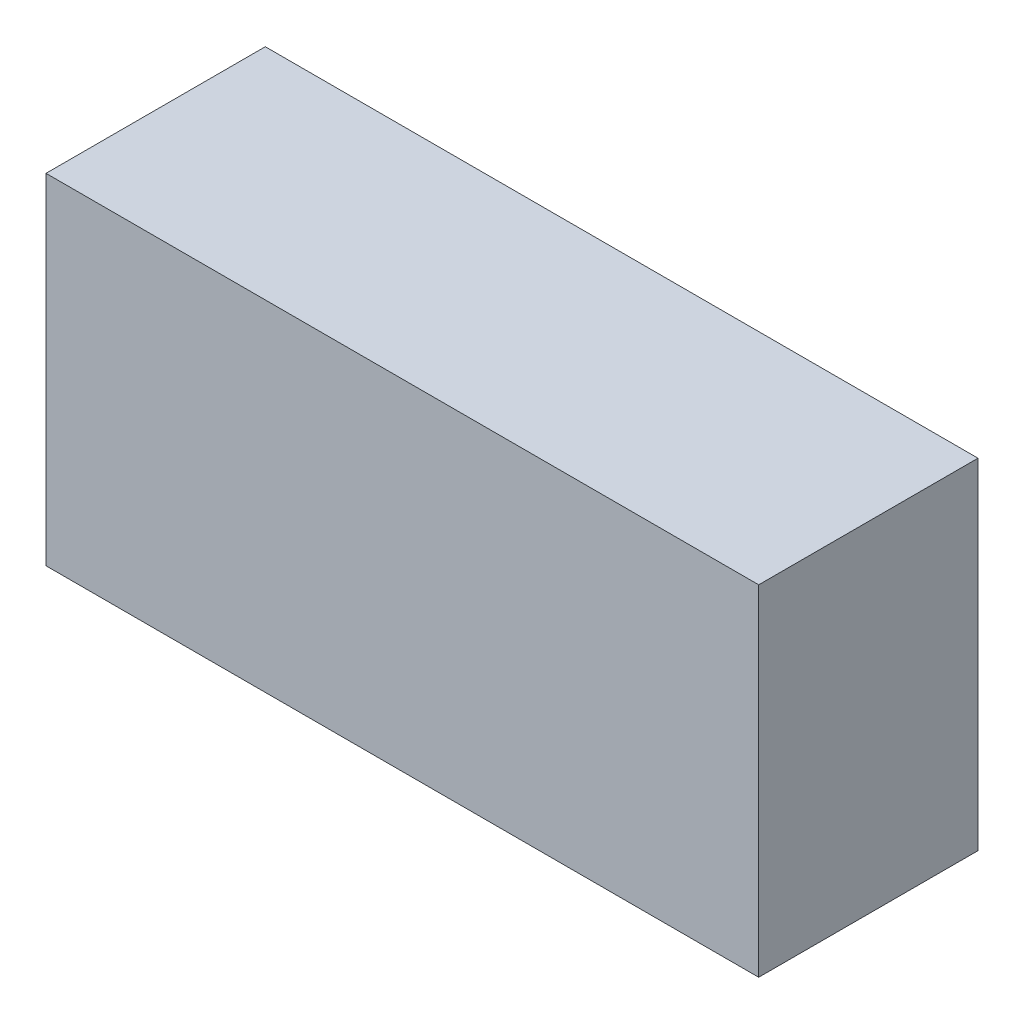
ISO-10303-21;
HEADER;
FILE_DESCRIPTION(('STEP AP214'),'2;1');
FILE_NAME('part.step','',(''),(''),'','','');
FILE_SCHEMA(('AUTOMOTIVE_DESIGN { 1 0 10303 214 1 1 1 1 }'));
ENDSEC;
DATA;
#1=APPLICATION_CONTEXT('core data for automotive mechanical design processes');
#2=APPLICATION_PROTOCOL_DEFINITION('international standard','automotive_design',2000,#1);
#3=PRODUCT_CONTEXT('',#1,'mechanical');
#4=PRODUCT('Part','Part','',(#3));
#5=PRODUCT_RELATED_PRODUCT_CATEGORY('part','',(#4));
#6=PRODUCT_DEFINITION_FORMATION('','',#4);
#7=PRODUCT_DEFINITION_CONTEXT('part definition',#1,'design');
#8=PRODUCT_DEFINITION('design','',#6,#7);
#9=PRODUCT_DEFINITION_SHAPE('','',#8);
#10=(LENGTH_UNIT() NAMED_UNIT(*) SI_UNIT(.MILLI.,.METRE.));
#11=(NAMED_UNIT(*) PLANE_ANGLE_UNIT() SI_UNIT($,.RADIAN.));
#12=(NAMED_UNIT(*) SI_UNIT($,.STERADIAN.) SOLID_ANGLE_UNIT());
#13=UNCERTAINTY_MEASURE_WITH_UNIT(LENGTH_MEASURE(1.E-05),#10,'distance_accuracy_value','');
#14=(GEOMETRIC_REPRESENTATION_CONTEXT(3) GLOBAL_UNCERTAINTY_ASSIGNED_CONTEXT((#13)) GLOBAL_UNIT_ASSIGNED_CONTEXT((#10,
#11,#12)) REPRESENTATION_CONTEXT('',''));
#15=CARTESIAN_POINT('',(0.,0.,0.));
#16=DIRECTION('',(0.,0.,1.));
#17=DIRECTION('',(1.,0.,0.));
#18=AXIS2_PLACEMENT_3D('',#15,#16,#17);
#19=CARTESIAN_POINT('',(9.75,9.3,-3.));
#20=DIRECTION('',(-1.,0.,0.));
#21=DIRECTION('',(0.,0.,1.));
#22=AXIS2_PLACEMENT_3D('',#19,#20,#21);
#23=PLANE('',#22);
#24=DIRECTION('',(0.,0.,-1.));
#25=VECTOR('',#24,1.);
#26=CARTESIAN_POINT('',(9.75,0.,-3.));
#27=LINE('',#26,#25);
#28=CARTESIAN_POINT('',(9.75,0.,3.));
#29=VERTEX_POINT('',#28);
#30=CARTESIAN_POINT('',(9.75,0.,-3.));
#31=VERTEX_POINT('',#30);
#32=EDGE_CURVE('E337',#29,#31,#27,.T.);
#33=ORIENTED_EDGE('',*,*,#32,.T.);
#34=DIRECTION('',(0.,-1.,0.));
#35=VECTOR('',#34,1.);
#36=CARTESIAN_POINT('',(9.75,9.3,-3.));
#37=LINE('',#36,#35);
#38=CARTESIAN_POINT('',(9.75,9.3,-3.));
#39=VERTEX_POINT('',#38);
#40=EDGE_CURVE('E11',#39,#31,#37,.T.);
#41=ORIENTED_EDGE('',*,*,#40,.F.);
#42=DIRECTION('',(0.,0.,-1.));
#43=VECTOR('',#42,1.);
#44=CARTESIAN_POINT('',(9.75,9.3,-3.));
#45=LINE('',#44,#43);
#46=CARTESIAN_POINT('',(9.75,9.3,3.));
#47=VERTEX_POINT('',#46);
#48=EDGE_CURVE('E348',#47,#39,#45,.T.);
#49=ORIENTED_EDGE('',*,*,#48,.F.);
#50=DIRECTION('',(0.,-1.,0.));
#51=VECTOR('',#50,1.);
#52=CARTESIAN_POINT('',(9.75,9.3,3.));
#53=LINE('',#52,#51);
#54=EDGE_CURVE('E362',#47,#29,#53,.T.);
#55=ORIENTED_EDGE('',*,*,#54,.T.);
#56=EDGE_LOOP('',(#33,#41,#49,#55));
#57=FACE_BOUND('',#56,.T.);
#58=ADVANCED_FACE('F39',(#57),#23,.F.);
#59=CARTESIAN_POINT('',(-9.75,9.3,-3.));
#60=DIRECTION('',(0.,0.,1.));
#61=DIRECTION('',(1.,0.,0.));
#62=AXIS2_PLACEMENT_3D('',#59,#60,#61);
#63=PLANE('',#62);
#64=DIRECTION('',(-1.,0.,0.));
#65=VECTOR('',#64,1.);
#66=CARTESIAN_POINT('',(-9.75,0.,-3.));
#67=LINE('',#66,#65);
#68=CARTESIAN_POINT('',(-9.75,0.,-3.));
#69=VERTEX_POINT('',#68);
#70=EDGE_CURVE('E366',#31,#69,#67,.T.);
#71=ORIENTED_EDGE('',*,*,#70,.T.);
#72=DIRECTION('',(0.,-1.,0.));
#73=VECTOR('',#72,1.);
#74=CARTESIAN_POINT('',(-9.75,9.3,-3.));
#75=LINE('',#74,#73);
#76=CARTESIAN_POINT('',(-9.75,9.3,-3.));
#77=VERTEX_POINT('',#76);
#78=EDGE_CURVE('E47',#77,#69,#75,.T.);
#79=ORIENTED_EDGE('',*,*,#78,.F.);
#80=DIRECTION('',(-1.,0.,0.));
#81=VECTOR('',#80,1.);
#82=CARTESIAN_POINT('',(-9.75,9.3,-3.));
#83=LINE('',#82,#81);
#84=EDGE_CURVE('E352',#39,#77,#83,.T.);
#85=ORIENTED_EDGE('',*,*,#84,.F.);
#86=ORIENTED_EDGE('',*,*,#40,.T.);
#87=EDGE_LOOP('',(#71,#79,#85,#86));
#88=FACE_BOUND('',#87,.T.);
#89=ADVANCED_FACE('F401',(#88),#63,.F.);
#90=CARTESIAN_POINT('',(-9.75,9.3,-3.));
#91=DIRECTION('',(1.,0.,0.));
#92=DIRECTION('',(0.,0.,-1.));
#93=AXIS2_PLACEMENT_3D('',#90,#91,#92);
#94=PLANE('',#93);
#95=DIRECTION('',(0.,0.,1.));
#96=VECTOR('',#95,1.);
#97=CARTESIAN_POINT('',(-9.75,0.,-3.));
#98=LINE('',#97,#96);
#99=CARTESIAN_POINT('',(-9.75,0.,3.));
#100=VERTEX_POINT('',#99);
#101=EDGE_CURVE('E369',#69,#100,#98,.T.);
#102=ORIENTED_EDGE('',*,*,#101,.T.);
#103=DIRECTION('',(0.,-1.,0.));
#104=VECTOR('',#103,1.);
#105=CARTESIAN_POINT('',(-9.75,9.3,3.));
#106=LINE('',#105,#104);
#107=CARTESIAN_POINT('',(-9.75,9.3,3.));
#108=VERTEX_POINT('',#107);
#109=EDGE_CURVE('E377',#108,#100,#106,.T.);
#110=ORIENTED_EDGE('',*,*,#109,.F.);
#111=DIRECTION('',(0.,0.,1.));
#112=VECTOR('',#111,1.);
#113=CARTESIAN_POINT('',(-9.75,9.3,-3.));
#114=LINE('',#113,#112);
#115=EDGE_CURVE('E356',#77,#108,#114,.T.);
#116=ORIENTED_EDGE('',*,*,#115,.F.);
#117=ORIENTED_EDGE('',*,*,#78,.T.);
#118=EDGE_LOOP('',(#102,#110,#116,#117));
#119=FACE_BOUND('',#118,.T.);
#120=ADVANCED_FACE('F386',(#119),#94,.F.);
#121=CARTESIAN_POINT('',(-9.75,9.3,3.));
#122=DIRECTION('',(0.,0.,-1.));
#123=DIRECTION('',(-1.,0.,0.));
#124=AXIS2_PLACEMENT_3D('',#121,#122,#123);
#125=PLANE('',#124);
#126=DIRECTION('',(1.,0.,0.));
#127=VECTOR('',#126,1.);
#128=CARTESIAN_POINT('',(-9.75,0.,3.));
#129=LINE('',#128,#127);
#130=EDGE_CURVE('E353',#100,#29,#129,.T.);
#131=ORIENTED_EDGE('',*,*,#130,.T.);
#132=ORIENTED_EDGE('',*,*,#54,.F.);
#133=DIRECTION('',(1.,0.,0.));
#134=VECTOR('',#133,1.);
#135=CARTESIAN_POINT('',(-9.75,9.3,3.));
#136=LINE('',#135,#134);
#137=EDGE_CURVE('E359',#108,#47,#136,.T.);
#138=ORIENTED_EDGE('',*,*,#137,.F.);
#139=ORIENTED_EDGE('',*,*,#109,.T.);
#140=EDGE_LOOP('',(#131,#132,#138,#139));
#141=FACE_BOUND('',#140,.T.);
#142=ADVANCED_FACE('F394',(#141),#125,.F.);
#143=CARTESIAN_POINT('',(0.,9.3,0.));
#144=DIRECTION('',(0.,1.,0.));
#145=DIRECTION('',(0.,0.,1.));
#146=AXIS2_PLACEMENT_3D('',#143,#144,#145);
#147=PLANE('',#146);
#148=ORIENTED_EDGE('',*,*,#48,.T.);
#149=ORIENTED_EDGE('',*,*,#84,.T.);
#150=ORIENTED_EDGE('',*,*,#115,.T.);
#151=ORIENTED_EDGE('',*,*,#137,.T.);
#152=EDGE_LOOP('',(#148,#149,#150,#151));
#153=FACE_BOUND('',#152,.T.);
#154=ADVANCED_FACE('F400',(#153),#147,.T.);
#155=CARTESIAN_POINT('',(0.,0.,0.));
#156=DIRECTION('',(0.,1.,0.));
#157=DIRECTION('',(0.,0.,1.));
#158=AXIS2_PLACEMENT_3D('',#155,#156,#157);
#159=PLANE('',#158);
#160=DIRECTION('',(0.,0.,-1.));
#161=VECTOR('',#160,1.);
#162=CARTESIAN_POINT('',(4.78,0.,-1.2));
#163=LINE('',#162,#161);
#164=CARTESIAN_POINT('',(4.78,0.,-1.2));
#165=VERTEX_POINT('',#164);
#166=CARTESIAN_POINT('',(4.78,0.,-1.5));
#167=VERTEX_POINT('',#166);
#168=EDGE_CURVE('E184',#165,#167,#163,.T.);
#169=ORIENTED_EDGE('',*,*,#168,.F.);
#170=DIRECTION('',(1.,0.,0.));
#171=VECTOR('',#170,1.);
#172=CARTESIAN_POINT('',(4.78,0.,-1.2));
#173=LINE('',#172,#171);
#174=CARTESIAN_POINT('',(5.38,0.,-1.2));
#175=VERTEX_POINT('',#174);
#176=EDGE_CURVE('E193',#165,#175,#173,.T.);
#177=ORIENTED_EDGE('',*,*,#176,.T.);
#178=DIRECTION('',(0.,0.,-1.));
#179=VECTOR('',#178,1.);
#180=CARTESIAN_POINT('',(5.38,0.,-1.2));
#181=LINE('',#180,#179);
#182=CARTESIAN_POINT('',(5.38,0.,-1.5));
#183=VERTEX_POINT('',#182);
#184=EDGE_CURVE('E201',#175,#183,#181,.T.);
#185=ORIENTED_EDGE('',*,*,#184,.T.);
#186=DIRECTION('',(1.,0.,0.));
#187=VECTOR('',#186,1.);
#188=CARTESIAN_POINT('',(4.78,0.,-1.5));
#189=LINE('',#188,#187);
#190=EDGE_CURVE('E54',#167,#183,#189,.T.);
#191=ORIENTED_EDGE('',*,*,#190,.F.);
#192=EDGE_LOOP('',(#169,#177,#185,#191));
#193=FACE_BOUND('',#192,.T.);
#194=DIRECTION('',(0.,0.,-1.));
#195=VECTOR('',#194,1.);
#196=CARTESIAN_POINT('',(-0.299999999999996,0.,-1.2));
#197=LINE('',#196,#195);
#198=CARTESIAN_POINT('',(-0.299999999999996,0.,-1.2));
#199=VERTEX_POINT('',#198);
#200=CARTESIAN_POINT('',(-0.299999999999996,0.,-1.5));
#201=VERTEX_POINT('',#200);
#202=EDGE_CURVE('E237',#199,#201,#197,.T.);
#203=ORIENTED_EDGE('',*,*,#202,.F.);
#204=DIRECTION('',(1.,0.,0.));
#205=VECTOR('',#204,1.);
#206=CARTESIAN_POINT('',(-0.299999999999996,0.,-1.2));
#207=LINE('',#206,#205);
#208=CARTESIAN_POINT('',(0.300000000000004,0.,-1.2));
#209=VERTEX_POINT('',#208);
#210=EDGE_CURVE('E247',#199,#209,#207,.T.);
#211=ORIENTED_EDGE('',*,*,#210,.T.);
#212=DIRECTION('',(0.,0.,-1.));
#213=VECTOR('',#212,1.);
#214=CARTESIAN_POINT('',(0.300000000000004,0.,-1.2));
#215=LINE('',#214,#213);
#216=CARTESIAN_POINT('',(0.300000000000004,0.,-1.5));
#217=VERTEX_POINT('',#216);
#218=EDGE_CURVE('E243',#209,#217,#215,.T.);
#219=ORIENTED_EDGE('',*,*,#218,.T.);
#220=DIRECTION('',(1.,0.,0.));
#221=VECTOR('',#220,1.);
#222=CARTESIAN_POINT('',(-0.299999999999996,0.,-1.5));
#223=LINE('',#222,#221);
#224=EDGE_CURVE('E62',#201,#217,#223,.T.);
#225=ORIENTED_EDGE('',*,*,#224,.F.);
#226=EDGE_LOOP('',(#203,#211,#219,#225));
#227=FACE_BOUND('',#226,.T.);
#228=DIRECTION('',(0.,0.,-1.));
#229=VECTOR('',#228,1.);
#230=CARTESIAN_POINT('',(-5.38,0.,-1.2));
#231=LINE('',#230,#229);
#232=CARTESIAN_POINT('',(-5.38,0.,-1.2));
#233=VERTEX_POINT('',#232);
#234=CARTESIAN_POINT('',(-5.38,0.,-1.5));
#235=VERTEX_POINT('',#234);
#236=EDGE_CURVE('E278',#233,#235,#231,.T.);
#237=ORIENTED_EDGE('',*,*,#236,.F.);
#238=DIRECTION('',(1.,0.,0.));
#239=VECTOR('',#238,1.);
#240=CARTESIAN_POINT('',(-5.38,0.,-1.2));
#241=LINE('',#240,#239);
#242=CARTESIAN_POINT('',(-4.78,0.,-1.2));
#243=VERTEX_POINT('',#242);
#244=EDGE_CURVE('E289',#233,#243,#241,.T.);
#245=ORIENTED_EDGE('',*,*,#244,.T.);
#246=DIRECTION('',(0.,0.,-1.));
#247=VECTOR('',#246,1.);
#248=CARTESIAN_POINT('',(-4.78,0.,-1.2));
#249=LINE('',#248,#247);
#250=CARTESIAN_POINT('',(-4.78,0.,-1.5));
#251=VERTEX_POINT('',#250);
#252=EDGE_CURVE('E285',#243,#251,#249,.T.);
#253=ORIENTED_EDGE('',*,*,#252,.T.);
#254=DIRECTION('',(1.,0.,0.));
#255=VECTOR('',#254,1.);
#256=CARTESIAN_POINT('',(-5.38,0.,-1.5));
#257=LINE('',#256,#255);
#258=EDGE_CURVE('E281',#235,#251,#257,.T.);
#259=ORIENTED_EDGE('',*,*,#258,.F.);
#260=EDGE_LOOP('',(#237,#245,#253,#259));
#261=FACE_BOUND('',#260,.T.);
#262=DIRECTION('',(0.,0.,-1.));
#263=VECTOR('',#262,1.);
#264=CARTESIAN_POINT('',(-7.92,0.,-1.2));
#265=LINE('',#264,#263);
#266=CARTESIAN_POINT('',(-7.92,0.,-1.2));
#267=VERTEX_POINT('',#266);
#268=CARTESIAN_POINT('',(-7.92,0.,-1.5));
#269=VERTEX_POINT('',#268);
#270=EDGE_CURVE('E311',#267,#269,#265,.T.);
#271=ORIENTED_EDGE('',*,*,#270,.F.);
#272=DIRECTION('',(1.,0.,0.));
#273=VECTOR('',#272,1.);
#274=CARTESIAN_POINT('',(-7.92,0.,-1.2));
#275=LINE('',#274,#273);
#276=CARTESIAN_POINT('',(-7.32,0.,-1.2));
#277=VERTEX_POINT('',#276);
#278=EDGE_CURVE('E293',#267,#277,#275,.T.);
#279=ORIENTED_EDGE('',*,*,#278,.T.);
#280=DIRECTION('',(0.,0.,-1.));
#281=VECTOR('',#280,1.);
#282=CARTESIAN_POINT('',(-7.32,0.,-1.2));
#283=LINE('',#282,#281);
#284=CARTESIAN_POINT('',(-7.31999999999999,0.,-1.5));
#285=VERTEX_POINT('',#284);
#286=EDGE_CURVE('E325',#277,#285,#283,.T.);
#287=ORIENTED_EDGE('',*,*,#286,.T.);
#288=DIRECTION('',(1.,0.,0.));
#289=VECTOR('',#288,1.);
#290=CARTESIAN_POINT('',(-7.92,0.,-1.5));
#291=LINE('',#290,#289);
#292=EDGE_CURVE('E329',#269,#285,#291,.T.);
#293=ORIENTED_EDGE('',*,*,#292,.F.);
#294=EDGE_LOOP('',(#271,#279,#287,#293));
#295=FACE_BOUND('',#294,.T.);
#296=ORIENTED_EDGE('',*,*,#32,.F.);
#297=ORIENTED_EDGE('',*,*,#130,.F.);
#298=ORIENTED_EDGE('',*,*,#101,.F.);
#299=ORIENTED_EDGE('',*,*,#70,.F.);
#300=EDGE_LOOP('',(#296,#297,#298,#299));
#301=FACE_BOUND('',#300,.T.);
#302=ADVANCED_FACE('F203',(#193,#227,#261,#295,#301),#159,.F.);
#303=CARTESIAN_POINT('',(-7.92,-3.,-1.2));
#304=DIRECTION('',(0.,0.,1.));
#305=DIRECTION('',(1.,0.,0.));
#306=AXIS2_PLACEMENT_3D('',#303,#304,#305);
#307=PLANE('',#306);
#308=ORIENTED_EDGE('',*,*,#278,.F.);
#309=DIRECTION('',(0.,1.,0.));
#310=VECTOR('',#309,1.);
#311=CARTESIAN_POINT('',(-7.92,-3.,-1.2));
#312=LINE('',#311,#310);
#313=CARTESIAN_POINT('',(-7.92,-3.,-1.2));
#314=VERTEX_POINT('',#313);
#315=EDGE_CURVE('E334',#314,#267,#312,.T.);
#316=ORIENTED_EDGE('',*,*,#315,.F.);
#317=DIRECTION('',(1.,0.,0.));
#318=VECTOR('',#317,1.);
#319=CARTESIAN_POINT('',(-7.92,-3.,-1.2));
#320=LINE('',#319,#318);
#321=CARTESIAN_POINT('',(-7.32,-3.,-1.2));
#322=VERTEX_POINT('',#321);
#323=EDGE_CURVE('E306',#314,#322,#320,.T.);
#324=ORIENTED_EDGE('',*,*,#323,.T.);
#325=DIRECTION('',(0.,1.,0.));
#326=VECTOR('',#325,1.);
#327=CARTESIAN_POINT('',(-7.32,-3.,-1.2));
#328=LINE('',#327,#326);
#329=EDGE_CURVE('E321',#322,#277,#328,.T.);
#330=ORIENTED_EDGE('',*,*,#329,.T.);
#331=EDGE_LOOP('',(#308,#316,#324,#330));
#332=FACE_BOUND('',#331,.T.);
#333=ADVANCED_FACE('F413',(#332),#307,.T.);
#334=CARTESIAN_POINT('',(-7.92,-3.,-1.2));
#335=DIRECTION('',(1.,0.,0.));
#336=DIRECTION('',(0.,0.,-1.));
#337=AXIS2_PLACEMENT_3D('',#334,#335,#336);
#338=PLANE('',#337);
#339=ORIENTED_EDGE('',*,*,#270,.T.);
#340=DIRECTION('',(0.,1.,0.));
#341=VECTOR('',#340,1.);
#342=CARTESIAN_POINT('',(-7.92,-3.,-1.5));
#343=LINE('',#342,#341);
#344=CARTESIAN_POINT('',(-7.92,-3.,-1.5));
#345=VERTEX_POINT('',#344);
#346=EDGE_CURVE('E338',#345,#269,#343,.T.);
#347=ORIENTED_EDGE('',*,*,#346,.F.);
#348=DIRECTION('',(0.,0.,-1.));
#349=VECTOR('',#348,1.);
#350=CARTESIAN_POINT('',(-7.92,-3.,-1.2));
#351=LINE('',#350,#349);
#352=EDGE_CURVE('E318',#314,#345,#351,.T.);
#353=ORIENTED_EDGE('',*,*,#352,.F.);
#354=ORIENTED_EDGE('',*,*,#315,.T.);
#355=EDGE_LOOP('',(#339,#347,#353,#354));
#356=FACE_BOUND('',#355,.T.);
#357=ADVANCED_FACE('F418',(#356),#338,.F.);
#358=CARTESIAN_POINT('',(-7.92,-3.,-1.5));
#359=DIRECTION('',(0.,0.,1.));
#360=DIRECTION('',(1.,0.,0.));
#361=AXIS2_PLACEMENT_3D('',#358,#359,#360);
#362=PLANE('',#361);
#363=ORIENTED_EDGE('',*,*,#292,.T.);
#364=DIRECTION('',(0.,1.,0.));
#365=VECTOR('',#364,1.);
#366=CARTESIAN_POINT('',(-7.31999999999999,-3.,-1.5));
#367=LINE('',#366,#365);
#368=CARTESIAN_POINT('',(-7.31999999999999,-3.,-1.5));
#369=VERTEX_POINT('',#368);
#370=EDGE_CURVE('E342',#369,#285,#367,.T.);
#371=ORIENTED_EDGE('',*,*,#370,.F.);
#372=DIRECTION('',(1.,0.,0.));
#373=VECTOR('',#372,1.);
#374=CARTESIAN_POINT('',(-7.92,-3.,-1.5));
#375=LINE('',#374,#373);
#376=EDGE_CURVE('E315',#345,#369,#375,.T.);
#377=ORIENTED_EDGE('',*,*,#376,.F.);
#378=ORIENTED_EDGE('',*,*,#346,.T.);
#379=EDGE_LOOP('',(#363,#371,#377,#378));
#380=FACE_BOUND('',#379,.T.);
#381=ADVANCED_FACE('F424',(#380),#362,.F.);
#382=CARTESIAN_POINT('',(-7.32,-3.,-1.2));
#383=DIRECTION('',(1.,0.,0.));
#384=DIRECTION('',(0.,0.,-1.));
#385=AXIS2_PLACEMENT_3D('',#382,#383,#384);
#386=PLANE('',#385);
#387=ORIENTED_EDGE('',*,*,#286,.F.);
#388=ORIENTED_EDGE('',*,*,#329,.F.);
#389=DIRECTION('',(0.,0.,-1.));
#390=VECTOR('',#389,1.);
#391=CARTESIAN_POINT('',(-7.32,-3.,-1.2));
#392=LINE('',#391,#390);
#393=EDGE_CURVE('E310',#322,#369,#392,.T.);
#394=ORIENTED_EDGE('',*,*,#393,.T.);
#395=ORIENTED_EDGE('',*,*,#370,.T.);
#396=EDGE_LOOP('',(#387,#388,#394,#395));
#397=FACE_BOUND('',#396,.T.);
#398=ADVANCED_FACE('F420',(#397),#386,.T.);
#399=CARTESIAN_POINT('',(0.,-3.,0.));
#400=DIRECTION('',(0.,1.,0.));
#401=DIRECTION('',(0.,0.,1.));
#402=AXIS2_PLACEMENT_3D('',#399,#400,#401);
#403=PLANE('',#402);
#404=ORIENTED_EDGE('',*,*,#323,.F.);
#405=ORIENTED_EDGE('',*,*,#352,.T.);
#406=ORIENTED_EDGE('',*,*,#376,.T.);
#407=ORIENTED_EDGE('',*,*,#393,.F.);
#408=EDGE_LOOP('',(#404,#405,#406,#407));
#409=FACE_BOUND('',#408,.T.);
#410=ADVANCED_FACE('F423',(#409),#403,.F.);
#411=CARTESIAN_POINT('',(-5.38,-3.,-1.2));
#412=DIRECTION('',(0.,0.,1.));
#413=DIRECTION('',(1.,0.,0.));
#414=AXIS2_PLACEMENT_3D('',#411,#412,#413);
#415=PLANE('',#414);
#416=ORIENTED_EDGE('',*,*,#244,.F.);
#417=DIRECTION('',(0.,1.,0.));
#418=VECTOR('',#417,1.);
#419=CARTESIAN_POINT('',(-5.38,-3.,-1.2));
#420=LINE('',#419,#418);
#421=CARTESIAN_POINT('',(-5.38,-3.,-1.2));
#422=VERTEX_POINT('',#421);
#423=EDGE_CURVE('E251',#422,#233,#420,.T.);
#424=ORIENTED_EDGE('',*,*,#423,.F.);
#425=DIRECTION('',(1.,0.,0.));
#426=VECTOR('',#425,1.);
#427=CARTESIAN_POINT('',(-5.38,-3.,-1.2));
#428=LINE('',#427,#426);
#429=CARTESIAN_POINT('',(-4.78,-3.,-1.2));
#430=VERTEX_POINT('',#429);
#431=EDGE_CURVE('E282',#422,#430,#428,.T.);
#432=ORIENTED_EDGE('',*,*,#431,.T.);
#433=DIRECTION('',(0.,1.,0.));
#434=VECTOR('',#433,1.);
#435=CARTESIAN_POINT('',(-4.78,-3.,-1.2));
#436=LINE('',#435,#434);
#437=EDGE_CURVE('E264',#430,#243,#436,.T.);
#438=ORIENTED_EDGE('',*,*,#437,.T.);
#439=EDGE_LOOP('',(#416,#424,#432,#438));
#440=FACE_BOUND('',#439,.T.);
#441=ADVANCED_FACE('F434',(#440),#415,.T.);
#442=CARTESIAN_POINT('',(-5.38,-3.,-1.2));
#443=DIRECTION('',(1.,0.,0.));
#444=DIRECTION('',(0.,0.,-1.));
#445=AXIS2_PLACEMENT_3D('',#442,#443,#444);
#446=PLANE('',#445);
#447=ORIENTED_EDGE('',*,*,#236,.T.);
#448=DIRECTION('',(0.,1.,0.));
#449=VECTOR('',#448,1.);
#450=CARTESIAN_POINT('',(-5.38,-3.,-1.5));
#451=LINE('',#450,#449);
#452=CARTESIAN_POINT('',(-5.38,-3.,-1.5));
#453=VERTEX_POINT('',#452);
#454=EDGE_CURVE('E272',#453,#235,#451,.T.);
#455=ORIENTED_EDGE('',*,*,#454,.F.);
#456=DIRECTION('',(0.,0.,-1.));
#457=VECTOR('',#456,1.);
#458=CARTESIAN_POINT('',(-5.38,-3.,-1.2));
#459=LINE('',#458,#457);
#460=EDGE_CURVE('E267',#422,#453,#459,.T.);
#461=ORIENTED_EDGE('',*,*,#460,.F.);
#462=ORIENTED_EDGE('',*,*,#423,.T.);
#463=EDGE_LOOP('',(#447,#455,#461,#462));
#464=FACE_BOUND('',#463,.T.);
#465=ADVANCED_FACE('F442',(#464),#446,.F.);
#466=CARTESIAN_POINT('',(-5.38,-3.,-1.5));
#467=DIRECTION('',(0.,0.,1.));
#468=DIRECTION('',(1.,0.,0.));
#469=AXIS2_PLACEMENT_3D('',#466,#467,#468);
#470=PLANE('',#469);
#471=ORIENTED_EDGE('',*,*,#258,.T.);
#472=DIRECTION('',(0.,1.,0.));
#473=VECTOR('',#472,1.);
#474=CARTESIAN_POINT('',(-4.78,-3.,-1.5));
#475=LINE('',#474,#473);
#476=CARTESIAN_POINT('',(-4.78,-3.,-1.5));
#477=VERTEX_POINT('',#476);
#478=EDGE_CURVE('E268',#477,#251,#475,.T.);
#479=ORIENTED_EDGE('',*,*,#478,.F.);
#480=DIRECTION('',(1.,0.,0.));
#481=VECTOR('',#480,1.);
#482=CARTESIAN_POINT('',(-5.38,-3.,-1.5));
#483=LINE('',#482,#481);
#484=EDGE_CURVE('E296',#453,#477,#483,.T.);
#485=ORIENTED_EDGE('',*,*,#484,.F.);
#486=ORIENTED_EDGE('',*,*,#454,.T.);
#487=EDGE_LOOP('',(#471,#479,#485,#486));
#488=FACE_BOUND('',#487,.T.);
#489=ADVANCED_FACE('F445',(#488),#470,.F.);
#490=CARTESIAN_POINT('',(-4.78,-3.,-1.2));
#491=DIRECTION('',(1.,0.,0.));
#492=DIRECTION('',(0.,0.,-1.));
#493=AXIS2_PLACEMENT_3D('',#490,#491,#492);
#494=PLANE('',#493);
#495=ORIENTED_EDGE('',*,*,#252,.F.);
#496=ORIENTED_EDGE('',*,*,#437,.F.);
#497=DIRECTION('',(0.,0.,-1.));
#498=VECTOR('',#497,1.);
#499=CARTESIAN_POINT('',(-4.78,-3.,-1.2));
#500=LINE('',#499,#498);
#501=EDGE_CURVE('E299',#430,#477,#500,.T.);
#502=ORIENTED_EDGE('',*,*,#501,.T.);
#503=ORIENTED_EDGE('',*,*,#478,.T.);
#504=EDGE_LOOP('',(#495,#496,#502,#503));
#505=FACE_BOUND('',#504,.T.);
#506=ADVANCED_FACE('F440',(#505),#494,.T.);
#507=CARTESIAN_POINT('',(0.,-3.,0.));
#508=DIRECTION('',(0.,1.,0.));
#509=DIRECTION('',(0.,0.,1.));
#510=AXIS2_PLACEMENT_3D('',#507,#508,#509);
#511=PLANE('',#510);
#512=ORIENTED_EDGE('',*,*,#431,.F.);
#513=ORIENTED_EDGE('',*,*,#460,.T.);
#514=ORIENTED_EDGE('',*,*,#484,.T.);
#515=ORIENTED_EDGE('',*,*,#501,.F.);
#516=EDGE_LOOP('',(#512,#513,#514,#515));
#517=FACE_BOUND('',#516,.T.);
#518=ADVANCED_FACE('F436',(#517),#511,.F.);
#519=CARTESIAN_POINT('',(-0.299999999999996,-3.,-1.2));
#520=DIRECTION('',(0.,0.,1.));
#521=DIRECTION('',(1.,0.,0.));
#522=AXIS2_PLACEMENT_3D('',#519,#520,#521);
#523=PLANE('',#522);
#524=ORIENTED_EDGE('',*,*,#210,.F.);
#525=DIRECTION('',(0.,1.,0.));
#526=VECTOR('',#525,1.);
#527=CARTESIAN_POINT('',(-0.299999999999996,-3.,-1.2));
#528=LINE('',#527,#526);
#529=CARTESIAN_POINT('',(-0.299999999999996,-3.,-1.2));
#530=VERTEX_POINT('',#529);
#531=EDGE_CURVE('E200',#530,#199,#528,.T.);
#532=ORIENTED_EDGE('',*,*,#531,.F.);
#533=DIRECTION('',(1.,0.,0.));
#534=VECTOR('',#533,1.);
#535=CARTESIAN_POINT('',(-0.299999999999996,-3.,-1.2));
#536=LINE('',#535,#534);
#537=CARTESIAN_POINT('',(0.300000000000004,-3.,-1.2));
#538=VERTEX_POINT('',#537);
#539=EDGE_CURVE('E240',#530,#538,#536,.T.);
#540=ORIENTED_EDGE('',*,*,#539,.T.);
#541=DIRECTION('',(0.,1.,0.));
#542=VECTOR('',#541,1.);
#543=CARTESIAN_POINT('',(0.300000000000004,-3.,-1.2));
#544=LINE('',#543,#542);
#545=EDGE_CURVE('E225',#538,#209,#544,.T.);
#546=ORIENTED_EDGE('',*,*,#545,.T.);
#547=EDGE_LOOP('',(#524,#532,#540,#546));
#548=FACE_BOUND('',#547,.T.);
#549=ADVANCED_FACE('F439',(#548),#523,.T.);
#550=CARTESIAN_POINT('',(-0.299999999999996,-3.,-1.2));
#551=DIRECTION('',(1.,0.,0.));
#552=DIRECTION('',(0.,0.,-1.));
#553=AXIS2_PLACEMENT_3D('',#550,#551,#552);
#554=PLANE('',#553);
#555=ORIENTED_EDGE('',*,*,#202,.T.);
#556=DIRECTION('',(0.,1.,0.));
#557=VECTOR('',#556,1.);
#558=CARTESIAN_POINT('',(-0.299999999999996,-3.,-1.5));
#559=LINE('',#558,#557);
#560=CARTESIAN_POINT('',(-0.299999999999996,-3.,-1.5));
#561=VERTEX_POINT('',#560);
#562=EDGE_CURVE('E232',#561,#201,#559,.T.);
#563=ORIENTED_EDGE('',*,*,#562,.F.);
#564=DIRECTION('',(0.,0.,-1.));
#565=VECTOR('',#564,1.);
#566=CARTESIAN_POINT('',(-0.299999999999996,-3.,-1.2));
#567=LINE('',#566,#565);
#568=EDGE_CURVE('E228',#530,#561,#567,.T.);
#569=ORIENTED_EDGE('',*,*,#568,.F.);
#570=ORIENTED_EDGE('',*,*,#531,.T.);
#571=EDGE_LOOP('',(#555,#563,#569,#570));
#572=FACE_BOUND('',#571,.T.);
#573=ADVANCED_FACE('F461',(#572),#554,.F.);
#574=CARTESIAN_POINT('',(-0.299999999999996,-3.,-1.5));
#575=DIRECTION('',(0.,0.,1.));
#576=DIRECTION('',(1.,0.,0.));
#577=AXIS2_PLACEMENT_3D('',#574,#575,#576);
#578=PLANE('',#577);
#579=ORIENTED_EDGE('',*,*,#224,.T.);
#580=DIRECTION('',(0.,1.,0.));
#581=VECTOR('',#580,1.);
#582=CARTESIAN_POINT('',(0.300000000000004,-3.,-1.5));
#583=LINE('',#582,#581);
#584=CARTESIAN_POINT('',(0.300000000000004,-3.,-1.5));
#585=VERTEX_POINT('',#584);
#586=EDGE_CURVE('E229',#585,#217,#583,.T.);
#587=ORIENTED_EDGE('',*,*,#586,.F.);
#588=DIRECTION('',(1.,0.,0.));
#589=VECTOR('',#588,1.);
#590=CARTESIAN_POINT('',(-0.299999999999996,-3.,-1.5));
#591=LINE('',#590,#589);
#592=EDGE_CURVE('E254',#561,#585,#591,.T.);
#593=ORIENTED_EDGE('',*,*,#592,.F.);
#594=ORIENTED_EDGE('',*,*,#562,.T.);
#595=EDGE_LOOP('',(#579,#587,#593,#594));
#596=FACE_BOUND('',#595,.T.);
#597=ADVANCED_FACE('F464',(#596),#578,.F.);
#598=CARTESIAN_POINT('',(0.300000000000004,-3.,-1.2));
#599=DIRECTION('',(1.,0.,0.));
#600=DIRECTION('',(0.,0.,-1.));
#601=AXIS2_PLACEMENT_3D('',#598,#599,#600);
#602=PLANE('',#601);
#603=ORIENTED_EDGE('',*,*,#218,.F.);
#604=ORIENTED_EDGE('',*,*,#545,.F.);
#605=DIRECTION('',(0.,0.,-1.));
#606=VECTOR('',#605,1.);
#607=CARTESIAN_POINT('',(0.300000000000004,-3.,-1.2));
#608=LINE('',#607,#606);
#609=EDGE_CURVE('E257',#538,#585,#608,.T.);
#610=ORIENTED_EDGE('',*,*,#609,.T.);
#611=ORIENTED_EDGE('',*,*,#586,.T.);
#612=EDGE_LOOP('',(#603,#604,#610,#611));
#613=FACE_BOUND('',#612,.T.);
#614=ADVANCED_FACE('F459',(#613),#602,.T.);
#615=CARTESIAN_POINT('',(0.,-3.,0.));
#616=DIRECTION('',(0.,1.,0.));
#617=DIRECTION('',(0.,0.,1.));
#618=AXIS2_PLACEMENT_3D('',#615,#616,#617);
#619=PLANE('',#618);
#620=ORIENTED_EDGE('',*,*,#539,.F.);
#621=ORIENTED_EDGE('',*,*,#568,.T.);
#622=ORIENTED_EDGE('',*,*,#592,.T.);
#623=ORIENTED_EDGE('',*,*,#609,.F.);
#624=EDGE_LOOP('',(#620,#621,#622,#623));
#625=FACE_BOUND('',#624,.T.);
#626=ADVANCED_FACE('F456',(#625),#619,.F.);
#627=CARTESIAN_POINT('',(4.78,-3.,-1.2));
#628=DIRECTION('',(0.,0.,1.));
#629=DIRECTION('',(1.,0.,0.));
#630=AXIS2_PLACEMENT_3D('',#627,#628,#629);
#631=PLANE('',#630);
#632=ORIENTED_EDGE('',*,*,#176,.F.);
#633=DIRECTION('',(0.,1.,0.));
#634=VECTOR('',#633,1.);
#635=CARTESIAN_POINT('',(4.78,-3.,-1.2));
#636=LINE('',#635,#634);
#637=CARTESIAN_POINT('',(4.78,-3.,-1.2));
#638=VERTEX_POINT('',#637);
#639=EDGE_CURVE('E179',#638,#165,#636,.T.);
#640=ORIENTED_EDGE('',*,*,#639,.F.);
#641=DIRECTION('',(1.,0.,0.));
#642=VECTOR('',#641,1.);
#643=CARTESIAN_POINT('',(4.78,-3.,-1.2));
#644=LINE('',#643,#642);
#645=CARTESIAN_POINT('',(5.38,-3.,-1.2));
#646=VERTEX_POINT('',#645);
#647=EDGE_CURVE('E206',#638,#646,#644,.T.);
#648=ORIENTED_EDGE('',*,*,#647,.T.);
#649=DIRECTION('',(0.,1.,0.));
#650=VECTOR('',#649,1.);
#651=CARTESIAN_POINT('',(5.38,-3.,-1.2));
#652=LINE('',#651,#650);
#653=EDGE_CURVE('E195',#646,#175,#652,.T.);
#654=ORIENTED_EDGE('',*,*,#653,.T.);
#655=EDGE_LOOP('',(#632,#640,#648,#654));
#656=FACE_BOUND('',#655,.T.);
#657=ADVANCED_FACE('F194',(#656),#631,.T.);
#658=CARTESIAN_POINT('',(4.78,-3.,-1.2));
#659=DIRECTION('',(1.,0.,0.));
#660=DIRECTION('',(0.,0.,-1.));
#661=AXIS2_PLACEMENT_3D('',#658,#659,#660);
#662=PLANE('',#661);
#663=ORIENTED_EDGE('',*,*,#168,.T.);
#664=DIRECTION('',(0.,1.,0.));
#665=VECTOR('',#664,1.);
#666=CARTESIAN_POINT('',(4.78,-3.,-1.5));
#667=LINE('',#666,#665);
#668=CARTESIAN_POINT('',(4.78,-3.,-1.5));
#669=VERTEX_POINT('',#668);
#670=EDGE_CURVE('E190',#669,#167,#667,.T.);
#671=ORIENTED_EDGE('',*,*,#670,.F.);
#672=DIRECTION('',(0.,0.,-1.));
#673=VECTOR('',#672,1.);
#674=CARTESIAN_POINT('',(4.78,-3.,-1.2));
#675=LINE('',#674,#673);
#676=EDGE_CURVE('E185',#638,#669,#675,.T.);
#677=ORIENTED_EDGE('',*,*,#676,.F.);
#678=ORIENTED_EDGE('',*,*,#639,.T.);
#679=EDGE_LOOP('',(#663,#671,#677,#678));
#680=FACE_BOUND('',#679,.T.);
#681=ADVANCED_FACE('F181',(#680),#662,.F.);
#682=CARTESIAN_POINT('',(4.78,-3.,-1.5));
#683=DIRECTION('',(0.,0.,1.));
#684=DIRECTION('',(1.,0.,0.));
#685=AXIS2_PLACEMENT_3D('',#682,#683,#684);
#686=PLANE('',#685);
#687=ORIENTED_EDGE('',*,*,#190,.T.);
#688=DIRECTION('',(0.,1.,0.));
#689=VECTOR('',#688,1.);
#690=CARTESIAN_POINT('',(5.38,-3.,-1.5));
#691=LINE('',#690,#689);
#692=CARTESIAN_POINT('',(5.38,-3.,-1.5));
#693=VERTEX_POINT('',#692);
#694=EDGE_CURVE('E643',#693,#183,#691,.T.);
#695=ORIENTED_EDGE('',*,*,#694,.F.);
#696=DIRECTION('',(1.,0.,0.));
#697=VECTOR('',#696,1.);
#698=CARTESIAN_POINT('',(4.78,-3.,-1.5));
#699=LINE('',#698,#697);
#700=EDGE_CURVE('E219',#669,#693,#699,.T.);
#701=ORIENTED_EDGE('',*,*,#700,.F.);
#702=ORIENTED_EDGE('',*,*,#670,.T.);
#703=EDGE_LOOP('',(#687,#695,#701,#702));
#704=FACE_BOUND('',#703,.T.);
#705=ADVANCED_FACE('F481',(#704),#686,.F.);
#706=CARTESIAN_POINT('',(5.38,-3.,-1.2));
#707=DIRECTION('',(1.,0.,0.));
#708=DIRECTION('',(0.,0.,-1.));
#709=AXIS2_PLACEMENT_3D('',#706,#707,#708);
#710=PLANE('',#709);
#711=ORIENTED_EDGE('',*,*,#184,.F.);
#712=ORIENTED_EDGE('',*,*,#653,.F.);
#713=DIRECTION('',(0.,0.,-1.));
#714=VECTOR('',#713,1.);
#715=CARTESIAN_POINT('',(5.38,-3.,-1.2));
#716=LINE('',#715,#714);
#717=EDGE_CURVE('E211',#646,#693,#716,.T.);
#718=ORIENTED_EDGE('',*,*,#717,.T.);
#719=ORIENTED_EDGE('',*,*,#694,.T.);
#720=EDGE_LOOP('',(#711,#712,#718,#719));
#721=FACE_BOUND('',#720,.T.);
#722=ADVANCED_FACE('F477',(#721),#710,.T.);
#723=CARTESIAN_POINT('',(0.,-3.,0.));
#724=DIRECTION('',(0.,1.,0.));
#725=DIRECTION('',(0.,0.,1.));
#726=AXIS2_PLACEMENT_3D('',#723,#724,#725);
#727=PLANE('',#726);
#728=ORIENTED_EDGE('',*,*,#647,.F.);
#729=ORIENTED_EDGE('',*,*,#676,.T.);
#730=ORIENTED_EDGE('',*,*,#700,.T.);
#731=ORIENTED_EDGE('',*,*,#717,.F.);
#732=EDGE_LOOP('',(#728,#729,#730,#731));
#733=FACE_BOUND('',#732,.T.);
#734=ADVANCED_FACE('F474',(#733),#727,.F.);
#735=CLOSED_SHELL('',(#58,#89,#120,#142,#154,#302,#333,#357,#381,#398,#410,#441,#465,#489,#506,
#518,#549,#573,#597,#614,#626,#657,#681,#705,#722,#734));
#736=MANIFOLD_SOLID_BREP('B2',#735);
#737=ADVANCED_BREP_SHAPE_REPRESENTATION('',(#18,#736),#14);
#738=SHAPE_DEFINITION_REPRESENTATION(#9,#737);
ENDSEC;
END-ISO-10303-21;
